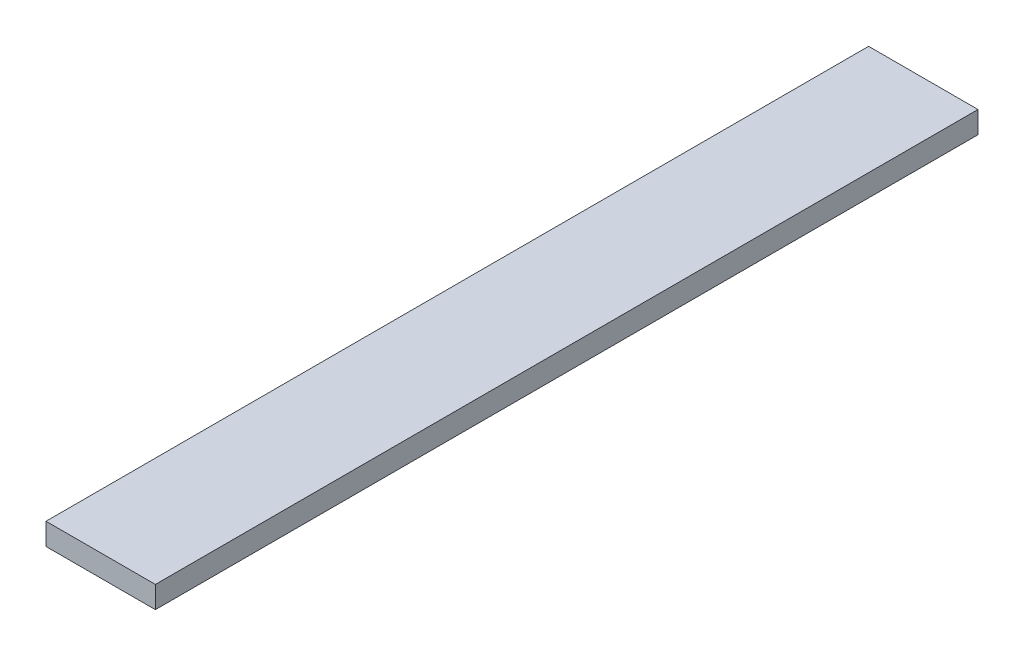
ISO-10303-21;
HEADER;
FILE_DESCRIPTION(('STEP AP214'),'2;1');
FILE_NAME('part.step','',(''),(''),'','','');
FILE_SCHEMA(('AUTOMOTIVE_DESIGN { 1 0 10303 214 1 1 1 1 }'));
ENDSEC;
DATA;
#1=APPLICATION_CONTEXT('core data for automotive mechanical design processes');
#2=APPLICATION_PROTOCOL_DEFINITION('international standard','automotive_design',2000,#1);
#3=PRODUCT_CONTEXT('',#1,'mechanical');
#4=PRODUCT('Part','Part','',(#3));
#5=PRODUCT_RELATED_PRODUCT_CATEGORY('part','',(#4));
#6=PRODUCT_DEFINITION_FORMATION('','',#4);
#7=PRODUCT_DEFINITION_CONTEXT('part definition',#1,'design');
#8=PRODUCT_DEFINITION('design','',#6,#7);
#9=PRODUCT_DEFINITION_SHAPE('','',#8);
#10=(LENGTH_UNIT() NAMED_UNIT(*) SI_UNIT(.MILLI.,.METRE.));
#11=(NAMED_UNIT(*) PLANE_ANGLE_UNIT() SI_UNIT($,.RADIAN.));
#12=(NAMED_UNIT(*) SI_UNIT($,.STERADIAN.) SOLID_ANGLE_UNIT());
#13=UNCERTAINTY_MEASURE_WITH_UNIT(LENGTH_MEASURE(1.E-05),#10,'distance_accuracy_value','');
#14=(GEOMETRIC_REPRESENTATION_CONTEXT(3) GLOBAL_UNCERTAINTY_ASSIGNED_CONTEXT((#13)) GLOBAL_UNIT_ASSIGNED_CONTEXT((#10,
#11,#12)) REPRESENTATION_CONTEXT('',''));
#15=CARTESIAN_POINT('',(0.,0.,0.));
#16=DIRECTION('',(0.,0.,1.));
#17=DIRECTION('',(1.,0.,0.));
#18=AXIS2_PLACEMENT_3D('',#15,#16,#17);
#19=CARTESIAN_POINT('',(0.,1.42999999999,0.));
#20=DIRECTION('',(0.,-1.,0.));
#21=DIRECTION('',(1.,0.,0.));
#22=AXIS2_PLACEMENT_3D('',#19,#20,#21);
#23=PLANE('',#22);
#24=DIRECTION('',(1.,0.,0.));
#25=VECTOR('',#24,1.);
#26=CARTESIAN_POINT('',(0.,1.42999999999,2.075));
#27=LINE('',#26,#25);
#28=CARTESIAN_POINT('',(-2.125,1.42999999999,2.075));
#29=VERTEX_POINT('',#28);
#30=CARTESIAN_POINT('',(-2.375,1.42999999999,2.075));
#31=VERTEX_POINT('',#30);
#32=EDGE_CURVE('E19',#29,#31,#27,.F.);
#33=ORIENTED_EDGE('',*,*,#32,.F.);
#34=DIRECTION('',(0.,0.,1.));
#35=VECTOR('',#34,1.);
#36=CARTESIAN_POINT('',(-2.125,1.42999999999,0.195));
#37=LINE('',#36,#35);
#38=CARTESIAN_POINT('',(-2.125,1.42999999999,0.195));
#39=VERTEX_POINT('',#38);
#40=EDGE_CURVE('E68',#29,#39,#37,.F.);
#41=ORIENTED_EDGE('',*,*,#40,.T.);
#42=DIRECTION('',(1.,0.,0.));
#43=VECTOR('',#42,1.);
#44=CARTESIAN_POINT('',(-2.375,1.42999999999,0.195));
#45=LINE('',#44,#43);
#46=CARTESIAN_POINT('',(-2.375,1.42999999999,0.195));
#47=VERTEX_POINT('',#46);
#48=EDGE_CURVE('E55',#39,#47,#45,.F.);
#49=ORIENTED_EDGE('',*,*,#48,.T.);
#50=DIRECTION('',(0.,0.,1.));
#51=VECTOR('',#50,1.);
#52=CARTESIAN_POINT('',(-2.375,1.42999999999,0.195));
#53=LINE('',#52,#51);
#54=EDGE_CURVE('E61',#47,#31,#53,.T.);
#55=ORIENTED_EDGE('',*,*,#54,.T.);
#56=EDGE_LOOP('',(#33,#41,#49,#55));
#57=FACE_BOUND('',#56,.T.);
#58=ADVANCED_FACE('F16',(#57),#23,.F.);
#59=CARTESIAN_POINT('',(-2.375,1.37999999999,0.195));
#60=DIRECTION('',(1.,0.,0.));
#61=DIRECTION('',(0.,1.,0.));
#62=AXIS2_PLACEMENT_3D('',#59,#60,#61);
#63=PLANE('',#62);
#64=DIRECTION('',(0.,1.,0.));
#65=VECTOR('',#64,1.);
#66=CARTESIAN_POINT('',(-2.375,1.37999999999,0.195));
#67=LINE('',#66,#65);
#68=CARTESIAN_POINT('',(-2.375,1.37999999999,0.195));
#69=VERTEX_POINT('',#68);
#70=EDGE_CURVE('E63',#47,#69,#67,.F.);
#71=ORIENTED_EDGE('',*,*,#70,.T.);
#72=DIRECTION('',(0.,0.,1.));
#73=VECTOR('',#72,1.);
#74=CARTESIAN_POINT('',(-2.375,1.37999999999,0.));
#75=LINE('',#74,#73);
#76=CARTESIAN_POINT('',(-2.375,1.37999999999,2.075));
#77=VERTEX_POINT('',#76);
#78=EDGE_CURVE('E82',#77,#69,#75,.F.);
#79=ORIENTED_EDGE('',*,*,#78,.F.);
#80=DIRECTION('',(0.,1.,0.));
#81=VECTOR('',#80,1.);
#82=CARTESIAN_POINT('',(-2.375,1.37999999999,2.075));
#83=LINE('',#82,#81);
#84=EDGE_CURVE('E66',#77,#31,#83,.T.);
#85=ORIENTED_EDGE('',*,*,#84,.T.);
#86=ORIENTED_EDGE('',*,*,#54,.F.);
#87=EDGE_LOOP('',(#71,#79,#85,#86));
#88=FACE_BOUND('',#87,.T.);
#89=ADVANCED_FACE('F62',(#88),#63,.F.);
#90=CARTESIAN_POINT('',(-2.375,1.37999999999,0.195));
#91=DIRECTION('',(0.,0.,1.));
#92=DIRECTION('',(1.,0.,0.));
#93=AXIS2_PLACEMENT_3D('',#90,#91,#92);
#94=PLANE('',#93);
#95=DIRECTION('',(0.,-1.,0.));
#96=VECTOR('',#95,1.);
#97=CARTESIAN_POINT('',(-2.125,1.37999999999,0.195));
#98=LINE('',#97,#96);
#99=CARTESIAN_POINT('',(-2.125,1.37999999999,0.195));
#100=VERTEX_POINT('',#99);
#101=EDGE_CURVE('E70',#39,#100,#98,.T.);
#102=ORIENTED_EDGE('',*,*,#101,.T.);
#103=DIRECTION('',(1.,0.,0.));
#104=VECTOR('',#103,1.);
#105=CARTESIAN_POINT('',(0.,1.37999999999,0.195));
#106=LINE('',#105,#104);
#107=EDGE_CURVE('E74',#69,#100,#106,.T.);
#108=ORIENTED_EDGE('',*,*,#107,.F.);
#109=ORIENTED_EDGE('',*,*,#70,.F.);
#110=ORIENTED_EDGE('',*,*,#48,.F.);
#111=EDGE_LOOP('',(#102,#108,#109,#110));
#112=FACE_BOUND('',#111,.T.);
#113=ADVANCED_FACE('F72',(#112),#94,.F.);
#114=CARTESIAN_POINT('',(-2.125,1.37999999999,0.195));
#115=DIRECTION('',(-1.,0.,0.));
#116=DIRECTION('',(0.,-1.,0.));
#117=AXIS2_PLACEMENT_3D('',#114,#115,#116);
#118=PLANE('',#117);
#119=DIRECTION('',(0.,1.,0.));
#120=VECTOR('',#119,1.);
#121=CARTESIAN_POINT('',(-2.125,1.37999999999,2.075));
#122=LINE('',#121,#120);
#123=CARTESIAN_POINT('',(-2.125,1.37999999999,2.075));
#124=VERTEX_POINT('',#123);
#125=EDGE_CURVE('E34',#29,#124,#122,.F.);
#126=ORIENTED_EDGE('',*,*,#125,.T.);
#127=DIRECTION('',(0.,0.,1.));
#128=VECTOR('',#127,1.);
#129=CARTESIAN_POINT('',(-2.125,1.37999999999,0.));
#130=LINE('',#129,#128);
#131=EDGE_CURVE('E25',#100,#124,#130,.T.);
#132=ORIENTED_EDGE('',*,*,#131,.F.);
#133=ORIENTED_EDGE('',*,*,#101,.F.);
#134=ORIENTED_EDGE('',*,*,#40,.F.);
#135=EDGE_LOOP('',(#126,#132,#133,#134));
#136=FACE_BOUND('',#135,.T.);
#137=ADVANCED_FACE('F88',(#136),#118,.F.);
#138=CARTESIAN_POINT('',(-2.375,1.37999999999,2.075));
#139=DIRECTION('',(0.,0.,-1.));
#140=DIRECTION('',(-1.,0.,0.));
#141=AXIS2_PLACEMENT_3D('',#138,#139,#140);
#142=PLANE('',#141);
#143=ORIENTED_EDGE('',*,*,#84,.F.);
#144=DIRECTION('',(1.,0.,0.));
#145=VECTOR('',#144,1.);
#146=CARTESIAN_POINT('',(0.,1.37999999999,2.075));
#147=LINE('',#146,#145);
#148=EDGE_CURVE('E11',#124,#77,#147,.F.);
#149=ORIENTED_EDGE('',*,*,#148,.F.);
#150=ORIENTED_EDGE('',*,*,#125,.F.);
#151=ORIENTED_EDGE('',*,*,#32,.T.);
#152=EDGE_LOOP('',(#143,#149,#150,#151));
#153=FACE_BOUND('',#152,.T.);
#154=ADVANCED_FACE('F90',(#153),#142,.F.);
#155=CARTESIAN_POINT('',(0.,1.37999999999,0.));
#156=DIRECTION('',(0.,-1.,0.));
#157=DIRECTION('',(1.,0.,0.));
#158=AXIS2_PLACEMENT_3D('',#155,#156,#157);
#159=PLANE('',#158);
#160=ORIENTED_EDGE('',*,*,#131,.T.);
#161=ORIENTED_EDGE('',*,*,#148,.T.);
#162=ORIENTED_EDGE('',*,*,#78,.T.);
#163=ORIENTED_EDGE('',*,*,#107,.T.);
#164=EDGE_LOOP('',(#160,#161,#162,#163));
#165=FACE_BOUND('',#164,.T.);
#166=ADVANCED_FACE('F87',(#165),#159,.T.);
#167=CLOSED_SHELL('',(#58,#89,#113,#137,#154,#166));
#168=MANIFOLD_SOLID_BREP('B1',#167);
#169=ADVANCED_BREP_SHAPE_REPRESENTATION('',(#18,#168),#14);
#170=SHAPE_DEFINITION_REPRESENTATION(#9,#169);
ENDSEC;
END-ISO-10303-21;
